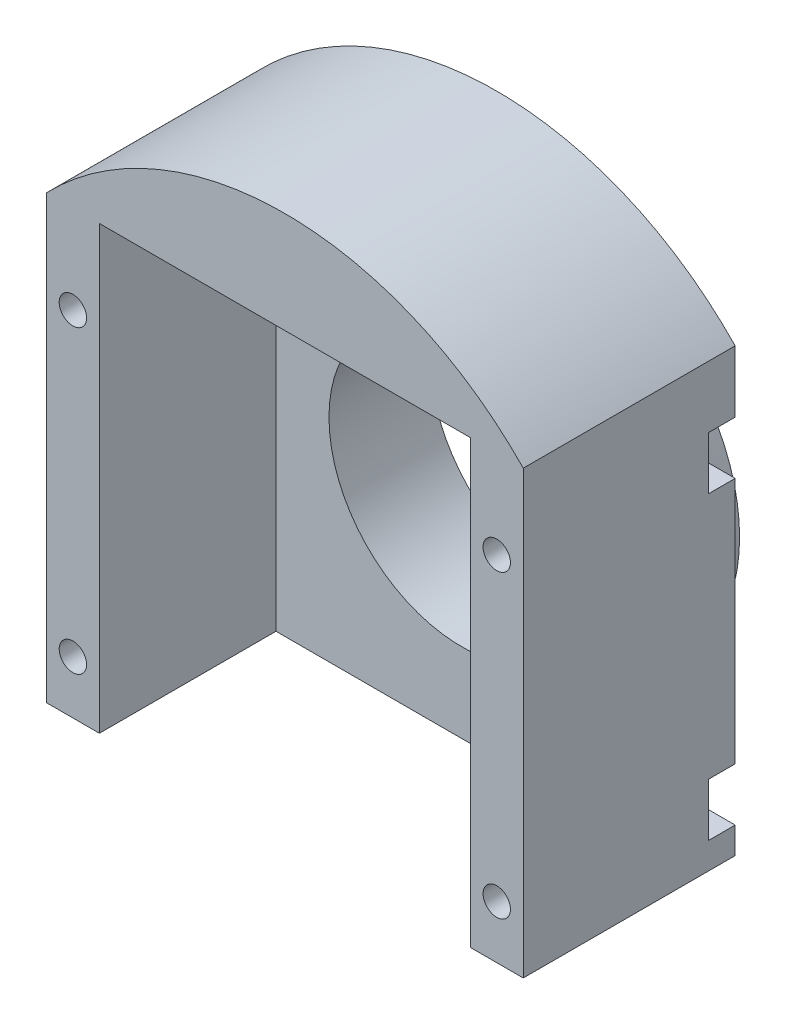
ISO-10303-21;
HEADER;
FILE_DESCRIPTION(('STEP AP214'),'2;1');
FILE_NAME('part.step','',(''),(''),'','','');
FILE_SCHEMA(('AUTOMOTIVE_DESIGN { 1 0 10303 214 1 1 1 1 }'));
ENDSEC;
DATA;
#1=APPLICATION_CONTEXT('core data for automotive mechanical design processes');
#2=APPLICATION_PROTOCOL_DEFINITION('international standard','automotive_design',2000,#1);
#3=PRODUCT_CONTEXT('',#1,'mechanical');
#4=PRODUCT('Part','Part','',(#3));
#5=PRODUCT_RELATED_PRODUCT_CATEGORY('part','',(#4));
#6=PRODUCT_DEFINITION_FORMATION('','',#4);
#7=PRODUCT_DEFINITION_CONTEXT('part definition',#1,'design');
#8=PRODUCT_DEFINITION('design','',#6,#7);
#9=PRODUCT_DEFINITION_SHAPE('','',#8);
#10=(LENGTH_UNIT() NAMED_UNIT(*) SI_UNIT(.MILLI.,.METRE.));
#11=(NAMED_UNIT(*) PLANE_ANGLE_UNIT() SI_UNIT($,.RADIAN.));
#12=(NAMED_UNIT(*) SI_UNIT($,.STERADIAN.) SOLID_ANGLE_UNIT());
#13=UNCERTAINTY_MEASURE_WITH_UNIT(LENGTH_MEASURE(1.E-05),#10,'distance_accuracy_value','');
#14=(GEOMETRIC_REPRESENTATION_CONTEXT(3) GLOBAL_UNCERTAINTY_ASSIGNED_CONTEXT((#13)) GLOBAL_UNIT_ASSIGNED_CONTEXT((#10,
#11,#12)) REPRESENTATION_CONTEXT('',''));
#15=CARTESIAN_POINT('',(0.,0.,0.));
#16=DIRECTION('',(0.,0.,1.));
#17=DIRECTION('',(1.,0.,0.));
#18=AXIS2_PLACEMENT_3D('',#15,#16,#17);
#19=CARTESIAN_POINT('',(0.,0.,0.));
#20=DIRECTION('',(0.,0.,1.));
#21=DIRECTION('',(1.,0.,0.));
#22=AXIS2_PLACEMENT_3D('',#19,#20,#21);
#23=PLANE('',#22);
#24=DIRECTION('',(0.,1.,0.));
#25=VECTOR('',#24,1.);
#26=CARTESIAN_POINT('',(27.,25.,0.));
#27=LINE('',#26,#25);
#28=CARTESIAN_POINT('',(27.,18.,0.));
#29=VERTEX_POINT('',#28);
#30=CARTESIAN_POINT('',(27.,25.,0.));
#31=VERTEX_POINT('',#30);
#32=EDGE_CURVE('E424',#29,#31,#27,.T.);
#33=ORIENTED_EDGE('',*,*,#32,.F.);
#34=DIRECTION('',(1.,0.,0.));
#35=VECTOR('',#34,1.);
#36=CARTESIAN_POINT('',(27.,18.,0.));
#37=LINE('',#36,#35);
#38=CARTESIAN_POINT('',(24.,18.,0.));
#39=VERTEX_POINT('',#38);
#40=EDGE_CURVE('E312',#39,#29,#37,.T.);
#41=ORIENTED_EDGE('',*,*,#40,.F.);
#42=CARTESIAN_POINT('',(24.,15.,0.));
#43=DIRECTION('',(0.,0.,-1.));
#44=DIRECTION('',(1.,0.,0.));
#45=AXIS2_PLACEMENT_3D('',#42,#43,#44);
#46=CIRCLE('',#45,3.);
#47=CARTESIAN_POINT('',(24.,12.,0.));
#48=VERTEX_POINT('',#47);
#49=EDGE_CURVE('E305',#48,#39,#46,.T.);
#50=ORIENTED_EDGE('',*,*,#49,.F.);
#51=DIRECTION('',(-1.,0.,0.));
#52=VECTOR('',#51,1.);
#53=CARTESIAN_POINT('',(24.,12.,0.));
#54=LINE('',#53,#52);
#55=CARTESIAN_POINT('',(27.,12.,0.));
#56=VERTEX_POINT('',#55);
#57=EDGE_CURVE('E308',#56,#48,#54,.T.);
#58=ORIENTED_EDGE('',*,*,#57,.F.);
#59=CARTESIAN_POINT('',(27.,-16.,0.));
#60=VERTEX_POINT('',#59);
#61=EDGE_CURVE('E902',#60,#56,#27,.T.);
#62=ORIENTED_EDGE('',*,*,#61,.F.);
#63=DIRECTION('',(1.,0.,0.));
#64=VECTOR('',#63,1.);
#65=CARTESIAN_POINT('',(27.,-16.,0.));
#66=LINE('',#65,#64);
#67=CARTESIAN_POINT('',(24.,-16.,0.));
#68=VERTEX_POINT('',#67);
#69=EDGE_CURVE('E354',#68,#60,#66,.T.);
#70=ORIENTED_EDGE('',*,*,#69,.F.);
#71=CARTESIAN_POINT('',(24.,-19.,0.));
#72=DIRECTION('',(0.,0.,-1.));
#73=DIRECTION('',(1.,0.,0.));
#74=AXIS2_PLACEMENT_3D('',#71,#72,#73);
#75=CIRCLE('',#74,3.);
#76=CARTESIAN_POINT('',(24.,-22.,0.));
#77=VERTEX_POINT('',#76);
#78=EDGE_CURVE('E366',#77,#68,#75,.T.);
#79=ORIENTED_EDGE('',*,*,#78,.F.);
#80=DIRECTION('',(-1.,0.,0.));
#81=VECTOR('',#80,1.);
#82=CARTESIAN_POINT('',(24.,-22.,0.));
#83=LINE('',#82,#81);
#84=CARTESIAN_POINT('',(27.,-22.,0.));
#85=VERTEX_POINT('',#84);
#86=EDGE_CURVE('E314',#85,#77,#83,.T.);
#87=ORIENTED_EDGE('',*,*,#86,.F.);
#88=CARTESIAN_POINT('',(27.,-25.,0.));
#89=VERTEX_POINT('',#88);
#90=EDGE_CURVE('E233',#89,#85,#27,.T.);
#91=ORIENTED_EDGE('',*,*,#90,.F.);
#92=DIRECTION('',(1.,0.,0.));
#93=VECTOR('',#92,1.);
#94=CARTESIAN_POINT('',(-27.,-25.,0.));
#95=LINE('',#94,#93);
#96=CARTESIAN_POINT('',(-27.,-25.,0.));
#97=VERTEX_POINT('',#96);
#98=EDGE_CURVE('E232',#97,#89,#95,.T.);
#99=ORIENTED_EDGE('',*,*,#98,.F.);
#100=DIRECTION('',(0.,-1.,0.));
#101=VECTOR('',#100,1.);
#102=CARTESIAN_POINT('',(-27.,25.,0.));
#103=LINE('',#102,#101);
#104=CARTESIAN_POINT('',(-27.,-22.,0.));
#105=VERTEX_POINT('',#104);
#106=EDGE_CURVE('E229',#105,#97,#103,.T.);
#107=ORIENTED_EDGE('',*,*,#106,.F.);
#108=DIRECTION('',(-1.,0.,0.));
#109=VECTOR('',#108,1.);
#110=CARTESIAN_POINT('',(-24.,-22.,0.));
#111=LINE('',#110,#109);
#112=CARTESIAN_POINT('',(-24.,-22.,0.));
#113=VERTEX_POINT('',#112);
#114=EDGE_CURVE('E333',#113,#105,#111,.T.);
#115=ORIENTED_EDGE('',*,*,#114,.F.);
#116=CARTESIAN_POINT('',(-24.,-19.,0.));
#117=DIRECTION('',(0.,0.,-1.));
#118=DIRECTION('',(-1.,0.,0.));
#119=AXIS2_PLACEMENT_3D('',#116,#117,#118);
#120=CIRCLE('',#119,3.);
#121=CARTESIAN_POINT('',(-24.,-16.,0.));
#122=VERTEX_POINT('',#121);
#123=EDGE_CURVE('E335',#122,#113,#120,.T.);
#124=ORIENTED_EDGE('',*,*,#123,.F.);
#125=DIRECTION('',(1.,0.,0.));
#126=VECTOR('',#125,1.);
#127=CARTESIAN_POINT('',(-27.,-16.,0.));
#128=LINE('',#127,#126);
#129=CARTESIAN_POINT('',(-27.,-16.,0.));
#130=VERTEX_POINT('',#129);
#131=EDGE_CURVE('E227',#130,#122,#128,.T.);
#132=ORIENTED_EDGE('',*,*,#131,.F.);
#133=CARTESIAN_POINT('',(-27.,12.,0.));
#134=VERTEX_POINT('',#133);
#135=EDGE_CURVE('E220',#134,#130,#103,.T.);
#136=ORIENTED_EDGE('',*,*,#135,.F.);
#137=DIRECTION('',(-1.,0.,0.));
#138=VECTOR('',#137,1.);
#139=CARTESIAN_POINT('',(-24.,12.,0.));
#140=LINE('',#139,#138);
#141=CARTESIAN_POINT('',(-24.,12.,0.));
#142=VERTEX_POINT('',#141);
#143=EDGE_CURVE('E201',#142,#134,#140,.T.);
#144=ORIENTED_EDGE('',*,*,#143,.F.);
#145=CARTESIAN_POINT('',(-24.,15.,0.));
#146=DIRECTION('',(0.,0.,-1.));
#147=DIRECTION('',(-1.,0.,0.));
#148=AXIS2_PLACEMENT_3D('',#145,#146,#147);
#149=CIRCLE('',#148,3.);
#150=CARTESIAN_POINT('',(-24.,18.,0.));
#151=VERTEX_POINT('',#150);
#152=EDGE_CURVE('E212',#151,#142,#149,.T.);
#153=ORIENTED_EDGE('',*,*,#152,.F.);
#154=DIRECTION('',(1.,0.,0.));
#155=VECTOR('',#154,1.);
#156=CARTESIAN_POINT('',(-27.,18.,0.));
#157=LINE('',#156,#155);
#158=CARTESIAN_POINT('',(-27.,18.,0.));
#159=VERTEX_POINT('',#158);
#160=EDGE_CURVE('E284',#159,#151,#157,.T.);
#161=ORIENTED_EDGE('',*,*,#160,.F.);
#162=CARTESIAN_POINT('',(-27.,25.,0.));
#163=VERTEX_POINT('',#162);
#164=EDGE_CURVE('E228',#163,#159,#103,.T.);
#165=ORIENTED_EDGE('',*,*,#164,.F.);
#166=CARTESIAN_POINT('',(0.,-0.999999999999997,0.));
#167=DIRECTION('',(0.,0.,1.));
#168=DIRECTION('',(1.,0.,0.));
#169=AXIS2_PLACEMENT_3D('',#166,#167,#168);
#170=CIRCLE('',#169,37.4833296279826);
#171=EDGE_CURVE('E407',#163,#31,#170,.F.);
#172=ORIENTED_EDGE('',*,*,#171,.T.);
#173=EDGE_LOOP('',(#33,#41,#50,#58,#62,#70,#79,#87,#91,#99,#107,#115,#124,#132,#136,#144,#153,
#161,#165,#172));
#174=FACE_BOUND('',#173,.T.);
#175=CARTESIAN_POINT('',(0.,-0.999999999999996,0.));
#176=DIRECTION('',(0.,0.,1.));
#177=DIRECTION('',(1.,0.,0.));
#178=AXIS2_PLACEMENT_3D('',#175,#176,#177);
#179=CIRCLE('',#178,21.);
#180=CARTESIAN_POINT('',(21.,-0.999999999999996,0.));
#181=VERTEX_POINT('',#180);
#182=EDGE_CURVE('E11',#181,#181,#179,.F.);
#183=ORIENTED_EDGE('',*,*,#182,.F.);
#184=EDGE_LOOP('',(#183));
#185=FACE_BOUND('',#184,.T.);
#186=ADVANCED_FACE('F39',(#174,#185),#23,.F.);
#187=CARTESIAN_POINT('',(-24.,15.,0.));
#188=DIRECTION('',(0.,0.,1.));
#189=DIRECTION('',(1.,0.,0.));
#190=AXIS2_PLACEMENT_3D('',#187,#188,#189);
#191=CYLINDRICAL_SURFACE('',#190,1.55);
#192=CARTESIAN_POINT('',(-24.,15.,24.));
#193=DIRECTION('',(0.,0.,1.));
#194=DIRECTION('',(1.,0.,0.));
#195=AXIS2_PLACEMENT_3D('',#192,#193,#194);
#196=CIRCLE('',#195,1.55);
#197=CARTESIAN_POINT('',(-22.45,15.,24.));
#198=VERTEX_POINT('',#197);
#199=EDGE_CURVE('E416',#198,#198,#196,.T.);
#200=ORIENTED_EDGE('',*,*,#199,.T.);
#201=EDGE_LOOP('',(#200));
#202=FACE_BOUND('',#201,.T.);
#203=CARTESIAN_POINT('',(-24.,15.,3.));
#204=DIRECTION('',(0.,0.,-1.));
#205=DIRECTION('',(-1.,0.,0.));
#206=AXIS2_PLACEMENT_3D('',#203,#204,#205);
#207=CIRCLE('',#206,1.55);
#208=CARTESIAN_POINT('',(-25.55,15.,3.));
#209=VERTEX_POINT('',#208);
#210=EDGE_CURVE('E261',#209,#209,#207,.F.);
#211=ORIENTED_EDGE('',*,*,#210,.F.);
#212=EDGE_LOOP('',(#211));
#213=FACE_BOUND('',#212,.T.);
#214=ADVANCED_FACE('F474',(#202,#213),#191,.F.);
#215=CARTESIAN_POINT('',(-24.,-19.,0.));
#216=DIRECTION('',(0.,0.,1.));
#217=DIRECTION('',(1.,0.,0.));
#218=AXIS2_PLACEMENT_3D('',#215,#216,#217);
#219=CYLINDRICAL_SURFACE('',#218,1.55);
#220=CARTESIAN_POINT('',(-24.,-19.,24.));
#221=DIRECTION('',(0.,0.,1.));
#222=DIRECTION('',(1.,0.,0.));
#223=AXIS2_PLACEMENT_3D('',#220,#221,#222);
#224=CIRCLE('',#223,1.55);
#225=CARTESIAN_POINT('',(-22.45,-19.,24.));
#226=VERTEX_POINT('',#225);
#227=EDGE_CURVE('E410',#226,#226,#224,.T.);
#228=ORIENTED_EDGE('',*,*,#227,.T.);
#229=EDGE_LOOP('',(#228));
#230=FACE_BOUND('',#229,.T.);
#231=CARTESIAN_POINT('',(-24.,-19.,3.));
#232=DIRECTION('',(0.,0.,-1.));
#233=DIRECTION('',(-1.,0.,0.));
#234=AXIS2_PLACEMENT_3D('',#231,#232,#233);
#235=CIRCLE('',#234,1.55);
#236=CARTESIAN_POINT('',(-25.55,-19.,3.));
#237=VERTEX_POINT('',#236);
#238=EDGE_CURVE('E251',#237,#237,#235,.F.);
#239=ORIENTED_EDGE('',*,*,#238,.F.);
#240=EDGE_LOOP('',(#239));
#241=FACE_BOUND('',#240,.T.);
#242=ADVANCED_FACE('F479',(#230,#241),#219,.F.);
#243=CARTESIAN_POINT('',(-27.,-25.,24.));
#244=DIRECTION('',(0.,1.,0.));
#245=DIRECTION('',(0.,0.,1.));
#246=AXIS2_PLACEMENT_3D('',#243,#244,#245);
#247=PLANE('',#246);
#248=DIRECTION('',(0.,0.,1.));
#249=VECTOR('',#248,1.);
#250=CARTESIAN_POINT('',(21.,-25.,4.));
#251=LINE('',#250,#249);
#252=CARTESIAN_POINT('',(21.,-25.,4.));
#253=VERTEX_POINT('',#252);
#254=CARTESIAN_POINT('',(21.,-25.,24.));
#255=VERTEX_POINT('',#254);
#256=EDGE_CURVE('E400',#253,#255,#251,.T.);
#257=ORIENTED_EDGE('',*,*,#256,.F.);
#258=DIRECTION('',(1.,0.,0.));
#259=VECTOR('',#258,1.);
#260=CARTESIAN_POINT('',(0.,-25.,4.));
#261=LINE('',#260,#259);
#262=CARTESIAN_POINT('',(-21.,-25.,4.));
#263=VERTEX_POINT('',#262);
#264=EDGE_CURVE('E383',#263,#253,#261,.T.);
#265=ORIENTED_EDGE('',*,*,#264,.F.);
#266=DIRECTION('',(0.,0.,1.));
#267=VECTOR('',#266,1.);
#268=CARTESIAN_POINT('',(-21.,-25.,4.));
#269=LINE('',#268,#267);
#270=CARTESIAN_POINT('',(-21.,-25.,24.));
#271=VERTEX_POINT('',#270);
#272=EDGE_CURVE('E402',#263,#271,#269,.T.);
#273=ORIENTED_EDGE('',*,*,#272,.T.);
#274=DIRECTION('',(1.,0.,0.));
#275=VECTOR('',#274,1.);
#276=CARTESIAN_POINT('',(-27.,-25.,24.));
#277=LINE('',#276,#275);
#278=CARTESIAN_POINT('',(-27.,-25.,24.));
#279=VERTEX_POINT('',#278);
#280=EDGE_CURVE('E243',#279,#271,#277,.T.);
#281=ORIENTED_EDGE('',*,*,#280,.F.);
#282=DIRECTION('',(0.,0.,-1.));
#283=VECTOR('',#282,1.);
#284=CARTESIAN_POINT('',(-27.,-25.,24.));
#285=LINE('',#284,#283);
#286=EDGE_CURVE('E242',#279,#97,#285,.T.);
#287=ORIENTED_EDGE('',*,*,#286,.T.);
#288=ORIENTED_EDGE('',*,*,#98,.T.);
#289=DIRECTION('',(0.,0.,-1.));
#290=VECTOR('',#289,1.);
#291=CARTESIAN_POINT('',(27.,-25.,24.));
#292=LINE('',#291,#290);
#293=CARTESIAN_POINT('',(27.,-25.,24.));
#294=VERTEX_POINT('',#293);
#295=EDGE_CURVE('E239',#294,#89,#292,.T.);
#296=ORIENTED_EDGE('',*,*,#295,.F.);
#297=EDGE_CURVE('E427',#255,#294,#277,.T.);
#298=ORIENTED_EDGE('',*,*,#297,.F.);
#299=EDGE_LOOP('',(#257,#265,#273,#281,#287,#288,#296,#298));
#300=FACE_BOUND('',#299,.T.);
#301=ADVANCED_FACE('F438',(#300),#247,.F.);
#302=CARTESIAN_POINT('',(0.,0.,24.));
#303=DIRECTION('',(0.,0.,1.));
#304=DIRECTION('',(1.,0.,0.));
#305=AXIS2_PLACEMENT_3D('',#302,#303,#304);
#306=PLANE('',#305);
#307=ORIENTED_EDGE('',*,*,#227,.F.);
#308=EDGE_LOOP('',(#307));
#309=FACE_BOUND('',#308,.T.);
#310=CARTESIAN_POINT('',(24.,-19.,24.));
#311=DIRECTION('',(0.,0.,1.));
#312=DIRECTION('',(1.,0.,0.));
#313=AXIS2_PLACEMENT_3D('',#310,#311,#312);
#314=CIRCLE('',#313,1.55000000000001);
#315=CARTESIAN_POINT('',(25.55,-19.,24.));
#316=VERTEX_POINT('',#315);
#317=EDGE_CURVE('E417',#316,#316,#314,.T.);
#318=ORIENTED_EDGE('',*,*,#317,.F.);
#319=EDGE_LOOP('',(#318));
#320=FACE_BOUND('',#319,.T.);
#321=CARTESIAN_POINT('',(24.,15.,24.));
#322=DIRECTION('',(0.,0.,1.));
#323=DIRECTION('',(1.,0.,0.));
#324=AXIS2_PLACEMENT_3D('',#321,#322,#323);
#325=CIRCLE('',#324,1.55000000000001);
#326=CARTESIAN_POINT('',(25.55,15.,24.));
#327=VERTEX_POINT('',#326);
#328=EDGE_CURVE('E413',#327,#327,#325,.T.);
#329=ORIENTED_EDGE('',*,*,#328,.F.);
#330=EDGE_LOOP('',(#329));
#331=FACE_BOUND('',#330,.T.);
#332=ORIENTED_EDGE('',*,*,#199,.F.);
#333=EDGE_LOOP('',(#332));
#334=FACE_BOUND('',#333,.T.);
#335=DIRECTION('',(1.,0.,0.));
#336=VECTOR('',#335,1.);
#337=CARTESIAN_POINT('',(0.,25.,24.));
#338=LINE('',#337,#336);
#339=CARTESIAN_POINT('',(-21.,25.,24.));
#340=VERTEX_POINT('',#339);
#341=CARTESIAN_POINT('',(21.,25.,24.));
#342=VERTEX_POINT('',#341);
#343=EDGE_CURVE('E263',#340,#342,#338,.T.);
#344=ORIENTED_EDGE('',*,*,#343,.T.);
#345=DIRECTION('',(0.,-1.,0.));
#346=VECTOR('',#345,1.);
#347=CARTESIAN_POINT('',(21.,0.,24.));
#348=LINE('',#347,#346);
#349=EDGE_CURVE('E381',#342,#255,#348,.T.);
#350=ORIENTED_EDGE('',*,*,#349,.T.);
#351=ORIENTED_EDGE('',*,*,#297,.T.);
#352=DIRECTION('',(0.,1.,0.));
#353=VECTOR('',#352,1.);
#354=CARTESIAN_POINT('',(27.,25.,24.));
#355=LINE('',#354,#353);
#356=CARTESIAN_POINT('',(27.,25.,24.));
#357=VERTEX_POINT('',#356);
#358=EDGE_CURVE('E238',#294,#357,#355,.T.);
#359=ORIENTED_EDGE('',*,*,#358,.T.);
#360=CARTESIAN_POINT('',(0.,-0.999999999999997,24.));
#361=DIRECTION('',(0.,0.,1.));
#362=DIRECTION('',(-1.,0.,0.));
#363=AXIS2_PLACEMENT_3D('',#360,#361,#362);
#364=CIRCLE('',#363,37.4833296279826);
#365=CARTESIAN_POINT('',(-27.,25.,24.));
#366=VERTEX_POINT('',#365);
#367=EDGE_CURVE('E399',#357,#366,#364,.T.);
#368=ORIENTED_EDGE('',*,*,#367,.T.);
#369=DIRECTION('',(0.,-1.,0.));
#370=VECTOR('',#369,1.);
#371=CARTESIAN_POINT('',(-27.,25.,24.));
#372=LINE('',#371,#370);
#373=EDGE_CURVE('E426',#366,#279,#372,.T.);
#374=ORIENTED_EDGE('',*,*,#373,.T.);
#375=ORIENTED_EDGE('',*,*,#280,.T.);
#376=DIRECTION('',(0.,1.,0.));
#377=VECTOR('',#376,1.);
#378=CARTESIAN_POINT('',(-21.,0.,24.));
#379=LINE('',#378,#377);
#380=EDGE_CURVE('E391',#271,#340,#379,.T.);
#381=ORIENTED_EDGE('',*,*,#380,.T.);
#382=EDGE_LOOP('',(#344,#350,#351,#359,#368,#374,#375,#381));
#383=FACE_BOUND('',#382,.T.);
#384=ADVANCED_FACE('F433',(#309,#320,#331,#334,#383),#306,.T.);
#385=CARTESIAN_POINT('',(27.,25.,24.));
#386=DIRECTION('',(-1.,0.,0.));
#387=DIRECTION('',(0.,0.,1.));
#388=AXIS2_PLACEMENT_3D('',#385,#386,#387);
#389=PLANE('',#388);
#390=DIRECTION('',(0.,-1.,0.));
#391=VECTOR('',#390,1.);
#392=CARTESIAN_POINT('',(27.,18.,3.));
#393=LINE('',#392,#391);
#394=CARTESIAN_POINT('',(27.,18.,3.));
#395=VERTEX_POINT('',#394);
#396=CARTESIAN_POINT('',(27.,12.,3.));
#397=VERTEX_POINT('',#396);
#398=EDGE_CURVE('E320',#395,#397,#393,.T.);
#399=ORIENTED_EDGE('',*,*,#398,.F.);
#400=DIRECTION('',(0.,0.,-1.));
#401=VECTOR('',#400,1.);
#402=CARTESIAN_POINT('',(27.,18.,3.));
#403=LINE('',#402,#401);
#404=EDGE_CURVE('E295',#395,#29,#403,.T.);
#405=ORIENTED_EDGE('',*,*,#404,.T.);
#406=ORIENTED_EDGE('',*,*,#32,.T.);
#407=DIRECTION('',(0.,0.,-1.));
#408=VECTOR('',#407,1.);
#409=CARTESIAN_POINT('',(27.,25.,24.));
#410=LINE('',#409,#408);
#411=EDGE_CURVE('E47',#357,#31,#410,.T.);
#412=ORIENTED_EDGE('',*,*,#411,.F.);
#413=ORIENTED_EDGE('',*,*,#358,.F.);
#414=ORIENTED_EDGE('',*,*,#295,.T.);
#415=ORIENTED_EDGE('',*,*,#90,.T.);
#416=DIRECTION('',(0.,0.,-1.));
#417=VECTOR('',#416,1.);
#418=CARTESIAN_POINT('',(27.,-22.,3.));
#419=LINE('',#418,#417);
#420=CARTESIAN_POINT('',(27.,-22.,3.));
#421=VERTEX_POINT('',#420);
#422=EDGE_CURVE('E363',#421,#85,#419,.T.);
#423=ORIENTED_EDGE('',*,*,#422,.F.);
#424=DIRECTION('',(0.,-1.,0.));
#425=VECTOR('',#424,1.);
#426=CARTESIAN_POINT('',(27.,-16.,3.));
#427=LINE('',#426,#425);
#428=CARTESIAN_POINT('',(27.,-16.,3.));
#429=VERTEX_POINT('',#428);
#430=EDGE_CURVE('E350',#429,#421,#427,.T.);
#431=ORIENTED_EDGE('',*,*,#430,.F.);
#432=DIRECTION('',(0.,0.,-1.));
#433=VECTOR('',#432,1.);
#434=CARTESIAN_POINT('',(27.,-16.,3.));
#435=LINE('',#434,#433);
#436=EDGE_CURVE('E255',#429,#60,#435,.T.);
#437=ORIENTED_EDGE('',*,*,#436,.T.);
#438=ORIENTED_EDGE('',*,*,#61,.T.);
#439=DIRECTION('',(0.,0.,-1.));
#440=VECTOR('',#439,1.);
#441=CARTESIAN_POINT('',(27.,12.,3.));
#442=LINE('',#441,#440);
#443=EDGE_CURVE('E299',#397,#56,#442,.T.);
#444=ORIENTED_EDGE('',*,*,#443,.F.);
#445=EDGE_LOOP('',(#399,#405,#406,#412,#413,#414,#415,#423,#431,#437,#438,#444));
#446=FACE_BOUND('',#445,.T.);
#447=ADVANCED_FACE('F41',(#446),#389,.F.);
#448=CARTESIAN_POINT('',(-27.,25.,24.));
#449=DIRECTION('',(1.,0.,0.));
#450=DIRECTION('',(0.,0.,-1.));
#451=AXIS2_PLACEMENT_3D('',#448,#449,#450);
#452=PLANE('',#451);
#453=DIRECTION('',(0.,1.,0.));
#454=VECTOR('',#453,1.);
#455=CARTESIAN_POINT('',(-27.,-16.,3.));
#456=LINE('',#455,#454);
#457=CARTESIAN_POINT('',(-27.,-22.,3.));
#458=VERTEX_POINT('',#457);
#459=CARTESIAN_POINT('',(-27.,-16.,3.));
#460=VERTEX_POINT('',#459);
#461=EDGE_CURVE('E336',#458,#460,#456,.T.);
#462=ORIENTED_EDGE('',*,*,#461,.F.);
#463=DIRECTION('',(0.,0.,-1.));
#464=VECTOR('',#463,1.);
#465=CARTESIAN_POINT('',(-27.,-22.,3.));
#466=LINE('',#465,#464);
#467=EDGE_CURVE('E286',#458,#105,#466,.T.);
#468=ORIENTED_EDGE('',*,*,#467,.T.);
#469=ORIENTED_EDGE('',*,*,#106,.T.);
#470=ORIENTED_EDGE('',*,*,#286,.F.);
#471=ORIENTED_EDGE('',*,*,#373,.F.);
#472=DIRECTION('',(0.,0.,-1.));
#473=VECTOR('',#472,1.);
#474=CARTESIAN_POINT('',(-27.,25.,24.));
#475=LINE('',#474,#473);
#476=EDGE_CURVE('E246',#366,#163,#475,.T.);
#477=ORIENTED_EDGE('',*,*,#476,.T.);
#478=ORIENTED_EDGE('',*,*,#164,.T.);
#479=DIRECTION('',(0.,0.,-1.));
#480=VECTOR('',#479,1.);
#481=CARTESIAN_POINT('',(-27.,18.,3.));
#482=LINE('',#481,#480);
#483=CARTESIAN_POINT('',(-27.,18.,3.));
#484=VERTEX_POINT('',#483);
#485=EDGE_CURVE('E62',#484,#159,#482,.T.);
#486=ORIENTED_EDGE('',*,*,#485,.F.);
#487=DIRECTION('',(0.,1.,0.));
#488=VECTOR('',#487,1.);
#489=CARTESIAN_POINT('',(-27.,18.,3.));
#490=LINE('',#489,#488);
#491=CARTESIAN_POINT('',(-27.,12.,3.));
#492=VERTEX_POINT('',#491);
#493=EDGE_CURVE('E213',#492,#484,#490,.T.);
#494=ORIENTED_EDGE('',*,*,#493,.F.);
#495=DIRECTION('',(0.,0.,-1.));
#496=VECTOR('',#495,1.);
#497=CARTESIAN_POINT('',(-27.,12.,3.));
#498=LINE('',#497,#496);
#499=EDGE_CURVE('E205',#492,#134,#498,.T.);
#500=ORIENTED_EDGE('',*,*,#499,.T.);
#501=ORIENTED_EDGE('',*,*,#135,.T.);
#502=DIRECTION('',(0.,0.,-1.));
#503=VECTOR('',#502,1.);
#504=CARTESIAN_POINT('',(-27.,-16.,3.));
#505=LINE('',#504,#503);
#506=EDGE_CURVE('E54',#460,#130,#505,.T.);
#507=ORIENTED_EDGE('',*,*,#506,.F.);
#508=EDGE_LOOP('',(#462,#468,#469,#470,#471,#477,#478,#486,#494,#500,#501,#507));
#509=FACE_BOUND('',#508,.T.);
#510=ADVANCED_FACE('F219',(#509),#452,.F.);
#511=CARTESIAN_POINT('',(24.,15.,0.));
#512=DIRECTION('',(0.,0.,1.));
#513=DIRECTION('',(1.,0.,0.));
#514=AXIS2_PLACEMENT_3D('',#511,#512,#513);
#515=CYLINDRICAL_SURFACE('',#514,1.55000000000001);
#516=CARTESIAN_POINT('',(24.,15.,3.));
#517=DIRECTION('',(0.,0.,1.));
#518=DIRECTION('',(1.,0.,0.));
#519=AXIS2_PLACEMENT_3D('',#516,#517,#518);
#520=CIRCLE('',#519,1.55000000000001);
#521=CARTESIAN_POINT('',(25.55,15.,3.));
#522=VERTEX_POINT('',#521);
#523=EDGE_CURVE('E258',#522,#522,#520,.F.);
#524=ORIENTED_EDGE('',*,*,#523,.T.);
#525=EDGE_LOOP('',(#524));
#526=FACE_BOUND('',#525,.T.);
#527=ORIENTED_EDGE('',*,*,#328,.T.);
#528=EDGE_LOOP('',(#527));
#529=FACE_BOUND('',#528,.T.);
#530=ADVANCED_FACE('F486',(#526,#529),#515,.F.);
#531=CARTESIAN_POINT('',(24.,-19.,0.));
#532=DIRECTION('',(0.,0.,1.));
#533=DIRECTION('',(1.,0.,0.));
#534=AXIS2_PLACEMENT_3D('',#531,#532,#533);
#535=CYLINDRICAL_SURFACE('',#534,1.55000000000001);
#536=CARTESIAN_POINT('',(24.,-19.,3.));
#537=DIRECTION('',(0.,0.,1.));
#538=DIRECTION('',(1.,0.,0.));
#539=AXIS2_PLACEMENT_3D('',#536,#537,#538);
#540=CIRCLE('',#539,1.55000000000001);
#541=CARTESIAN_POINT('',(25.55,-19.,3.));
#542=VERTEX_POINT('',#541);
#543=EDGE_CURVE('E254',#542,#542,#540,.F.);
#544=ORIENTED_EDGE('',*,*,#543,.T.);
#545=EDGE_LOOP('',(#544));
#546=FACE_BOUND('',#545,.T.);
#547=ORIENTED_EDGE('',*,*,#317,.T.);
#548=EDGE_LOOP('',(#547));
#549=FACE_BOUND('',#548,.T.);
#550=ADVANCED_FACE('F491',(#546,#549),#535,.F.);
#551=CARTESIAN_POINT('',(0.,-0.999999999999997,-55.2074891599401));
#552=DIRECTION('',(0.,0.,1.));
#553=DIRECTION('',(1.,0.,0.));
#554=AXIS2_PLACEMENT_3D('',#551,#552,#553);
#555=CYLINDRICAL_SURFACE('',#554,37.4833296279826);
#556=ORIENTED_EDGE('',*,*,#171,.F.);
#557=ORIENTED_EDGE('',*,*,#476,.F.);
#558=ORIENTED_EDGE('',*,*,#367,.F.);
#559=ORIENTED_EDGE('',*,*,#411,.T.);
#560=EDGE_LOOP('',(#556,#557,#558,#559));
#561=FACE_BOUND('',#560,.T.);
#562=ADVANCED_FACE('F448',(#561),#555,.T.);
#563=CARTESIAN_POINT('',(0.,25.,4.));
#564=DIRECTION('',(0.,-1.,0.));
#565=DIRECTION('',(0.,0.,-1.));
#566=AXIS2_PLACEMENT_3D('',#563,#564,#565);
#567=PLANE('',#566);
#568=ORIENTED_EDGE('',*,*,#343,.F.);
#569=DIRECTION('',(0.,0.,1.));
#570=VECTOR('',#569,1.);
#571=CARTESIAN_POINT('',(-21.,25.,4.));
#572=LINE('',#571,#570);
#573=CARTESIAN_POINT('',(-21.,25.,4.));
#574=VERTEX_POINT('',#573);
#575=EDGE_CURVE('E388',#574,#340,#572,.T.);
#576=ORIENTED_EDGE('',*,*,#575,.F.);
#577=DIRECTION('',(1.,0.,0.));
#578=VECTOR('',#577,1.);
#579=CARTESIAN_POINT('',(0.,25.,4.));
#580=LINE('',#579,#578);
#581=CARTESIAN_POINT('',(21.,25.,4.));
#582=VERTEX_POINT('',#581);
#583=EDGE_CURVE('E377',#574,#582,#580,.T.);
#584=ORIENTED_EDGE('',*,*,#583,.T.);
#585=DIRECTION('',(0.,0.,1.));
#586=VECTOR('',#585,1.);
#587=CARTESIAN_POINT('',(21.,25.,4.));
#588=LINE('',#587,#586);
#589=EDGE_CURVE('E396',#582,#342,#588,.T.);
#590=ORIENTED_EDGE('',*,*,#589,.T.);
#591=EDGE_LOOP('',(#568,#576,#584,#590));
#592=FACE_BOUND('',#591,.T.);
#593=ADVANCED_FACE('F461',(#592),#567,.T.);
#594=CARTESIAN_POINT('',(21.,0.,4.));
#595=DIRECTION('',(-1.,0.,0.));
#596=DIRECTION('',(0.,-1.,0.));
#597=AXIS2_PLACEMENT_3D('',#594,#595,#596);
#598=PLANE('',#597);
#599=ORIENTED_EDGE('',*,*,#349,.F.);
#600=ORIENTED_EDGE('',*,*,#589,.F.);
#601=DIRECTION('',(0.,-1.,0.));
#602=VECTOR('',#601,1.);
#603=CARTESIAN_POINT('',(21.,0.,4.));
#604=LINE('',#603,#602);
#605=EDGE_CURVE('E386',#582,#253,#604,.T.);
#606=ORIENTED_EDGE('',*,*,#605,.T.);
#607=ORIENTED_EDGE('',*,*,#256,.T.);
#608=EDGE_LOOP('',(#599,#600,#606,#607));
#609=FACE_BOUND('',#608,.T.);
#610=ADVANCED_FACE('F463',(#609),#598,.T.);
#611=CARTESIAN_POINT('',(-21.,0.,4.));
#612=DIRECTION('',(1.,0.,0.));
#613=DIRECTION('',(0.,0.,-1.));
#614=AXIS2_PLACEMENT_3D('',#611,#612,#613);
#615=PLANE('',#614);
#616=ORIENTED_EDGE('',*,*,#380,.F.);
#617=ORIENTED_EDGE('',*,*,#272,.F.);
#618=DIRECTION('',(0.,1.,0.));
#619=VECTOR('',#618,1.);
#620=CARTESIAN_POINT('',(-21.,0.,4.));
#621=LINE('',#620,#619);
#622=EDGE_CURVE('E380',#263,#574,#621,.T.);
#623=ORIENTED_EDGE('',*,*,#622,.T.);
#624=ORIENTED_EDGE('',*,*,#575,.T.);
#625=EDGE_LOOP('',(#616,#617,#623,#624));
#626=FACE_BOUND('',#625,.T.);
#627=ADVANCED_FACE('F454',(#626),#615,.T.);
#628=CARTESIAN_POINT('',(0.,0.,4.));
#629=DIRECTION('',(0.,0.,1.));
#630=DIRECTION('',(1.,0.,0.));
#631=AXIS2_PLACEMENT_3D('',#628,#629,#630);
#632=PLANE('',#631);
#633=CARTESIAN_POINT('',(0.,-0.999999999999996,4.));
#634=DIRECTION('',(0.,0.,1.));
#635=DIRECTION('',(1.,0.,0.));
#636=AXIS2_PLACEMENT_3D('',#633,#634,#635);
#637=CIRCLE('',#636,15.);
#638=CARTESIAN_POINT('',(15.,-0.999999999999996,4.));
#639=VERTEX_POINT('',#638);
#640=EDGE_CURVE('E222',#639,#639,#637,.T.);
#641=ORIENTED_EDGE('',*,*,#640,.F.);
#642=EDGE_LOOP('',(#641));
#643=FACE_BOUND('',#642,.T.);
#644=ORIENTED_EDGE('',*,*,#583,.F.);
#645=ORIENTED_EDGE('',*,*,#622,.F.);
#646=ORIENTED_EDGE('',*,*,#264,.T.);
#647=ORIENTED_EDGE('',*,*,#605,.F.);
#648=EDGE_LOOP('',(#644,#645,#646,#647));
#649=FACE_BOUND('',#648,.T.);
#650=ADVANCED_FACE('F458',(#643,#649),#632,.T.);
#651=CARTESIAN_POINT('',(-24.,-19.,3.));
#652=DIRECTION('',(0.,0.,-1.));
#653=DIRECTION('',(-1.,0.,0.));
#654=AXIS2_PLACEMENT_3D('',#651,#652,#653);
#655=PLANE('',#654);
#656=ORIENTED_EDGE('',*,*,#461,.T.);
#657=DIRECTION('',(1.,0.,0.));
#658=VECTOR('',#657,1.);
#659=CARTESIAN_POINT('',(-27.,-16.,3.));
#660=LINE('',#659,#658);
#661=CARTESIAN_POINT('',(-24.,-16.,3.));
#662=VERTEX_POINT('',#661);
#663=EDGE_CURVE('E345',#460,#662,#660,.T.);
#664=ORIENTED_EDGE('',*,*,#663,.T.);
#665=CARTESIAN_POINT('',(-24.,-19.,3.));
#666=DIRECTION('',(0.,0.,-1.));
#667=DIRECTION('',(-1.,0.,0.));
#668=AXIS2_PLACEMENT_3D('',#665,#666,#667);
#669=CIRCLE('',#668,3.);
#670=CARTESIAN_POINT('',(-24.,-22.,3.));
#671=VERTEX_POINT('',#670);
#672=EDGE_CURVE('E342',#662,#671,#669,.T.);
#673=ORIENTED_EDGE('',*,*,#672,.T.);
#674=DIRECTION('',(-1.,0.,0.));
#675=VECTOR('',#674,1.);
#676=CARTESIAN_POINT('',(-24.,-22.,3.));
#677=LINE('',#676,#675);
#678=EDGE_CURVE('E326',#671,#458,#677,.T.);
#679=ORIENTED_EDGE('',*,*,#678,.T.);
#680=EDGE_LOOP('',(#656,#664,#673,#679));
#681=FACE_BOUND('',#680,.T.);
#682=ORIENTED_EDGE('',*,*,#238,.T.);
#683=EDGE_LOOP('',(#682));
#684=FACE_BOUND('',#683,.T.);
#685=ADVANCED_FACE('F549',(#681,#684),#655,.T.);
#686=CARTESIAN_POINT('',(-24.,-22.,3.));
#687=DIRECTION('',(0.,-1.,0.));
#688=DIRECTION('',(0.,0.,-1.));
#689=AXIS2_PLACEMENT_3D('',#686,#687,#688);
#690=PLANE('',#689);
#691=ORIENTED_EDGE('',*,*,#114,.T.);
#692=ORIENTED_EDGE('',*,*,#467,.F.);
#693=ORIENTED_EDGE('',*,*,#678,.F.);
#694=DIRECTION('',(0.,0.,-1.));
#695=VECTOR('',#694,1.);
#696=CARTESIAN_POINT('',(-24.,-22.,3.));
#697=LINE('',#696,#695);
#698=EDGE_CURVE('E329',#671,#113,#697,.T.);
#699=ORIENTED_EDGE('',*,*,#698,.T.);
#700=EDGE_LOOP('',(#691,#692,#693,#699));
#701=FACE_BOUND('',#700,.T.);
#702=ADVANCED_FACE('F545',(#701),#690,.F.);
#703=CARTESIAN_POINT('',(-24.,-19.,3.));
#704=DIRECTION('',(0.,0.,-1.));
#705=DIRECTION('',(-1.,0.,0.));
#706=AXIS2_PLACEMENT_3D('',#703,#704,#705);
#707=CYLINDRICAL_SURFACE('',#706,3.);
#708=ORIENTED_EDGE('',*,*,#123,.T.);
#709=ORIENTED_EDGE('',*,*,#698,.F.);
#710=ORIENTED_EDGE('',*,*,#672,.F.);
#711=DIRECTION('',(0.,0.,-1.));
#712=VECTOR('',#711,1.);
#713=CARTESIAN_POINT('',(-24.,-16.,3.));
#714=LINE('',#713,#712);
#715=EDGE_CURVE('E327',#662,#122,#714,.T.);
#716=ORIENTED_EDGE('',*,*,#715,.T.);
#717=EDGE_LOOP('',(#708,#709,#710,#716));
#718=FACE_BOUND('',#717,.T.);
#719=ADVANCED_FACE('F542',(#718),#707,.F.);
#720=CARTESIAN_POINT('',(-27.,-16.,3.));
#721=DIRECTION('',(0.,1.,0.));
#722=DIRECTION('',(0.,0.,1.));
#723=AXIS2_PLACEMENT_3D('',#720,#721,#722);
#724=PLANE('',#723);
#725=ORIENTED_EDGE('',*,*,#131,.T.);
#726=ORIENTED_EDGE('',*,*,#715,.F.);
#727=ORIENTED_EDGE('',*,*,#663,.F.);
#728=ORIENTED_EDGE('',*,*,#506,.T.);
#729=EDGE_LOOP('',(#725,#726,#727,#728));
#730=FACE_BOUND('',#729,.T.);
#731=ADVANCED_FACE('F538',(#730),#724,.F.);
#732=CARTESIAN_POINT('',(24.,-19.,3.));
#733=DIRECTION('',(0.,0.,1.));
#734=DIRECTION('',(1.,0.,0.));
#735=AXIS2_PLACEMENT_3D('',#732,#733,#734);
#736=PLANE('',#735);
#737=ORIENTED_EDGE('',*,*,#430,.T.);
#738=DIRECTION('',(-1.,0.,0.));
#739=VECTOR('',#738,1.);
#740=CARTESIAN_POINT('',(24.,-22.,3.));
#741=LINE('',#740,#739);
#742=CARTESIAN_POINT('',(24.,-22.,3.));
#743=VERTEX_POINT('',#742);
#744=EDGE_CURVE('E353',#421,#743,#741,.T.);
#745=ORIENTED_EDGE('',*,*,#744,.T.);
#746=CARTESIAN_POINT('',(24.,-19.,3.));
#747=DIRECTION('',(0.,0.,-1.));
#748=DIRECTION('',(1.,0.,0.));
#749=AXIS2_PLACEMENT_3D('',#746,#747,#748);
#750=CIRCLE('',#749,3.);
#751=CARTESIAN_POINT('',(24.,-16.,3.));
#752=VERTEX_POINT('',#751);
#753=EDGE_CURVE('E357',#743,#752,#750,.T.);
#754=ORIENTED_EDGE('',*,*,#753,.T.);
#755=DIRECTION('',(1.,0.,0.));
#756=VECTOR('',#755,1.);
#757=CARTESIAN_POINT('',(27.,-16.,3.));
#758=LINE('',#757,#756);
#759=EDGE_CURVE('E360',#752,#429,#758,.T.);
#760=ORIENTED_EDGE('',*,*,#759,.T.);
#761=EDGE_LOOP('',(#737,#745,#754,#760));
#762=FACE_BOUND('',#761,.T.);
#763=ORIENTED_EDGE('',*,*,#543,.F.);
#764=EDGE_LOOP('',(#763));
#765=FACE_BOUND('',#764,.T.);
#766=ADVANCED_FACE('F541',(#762,#765),#736,.F.);
#767=CARTESIAN_POINT('',(27.,-16.,3.));
#768=DIRECTION('',(0.,1.,0.));
#769=DIRECTION('',(0.,0.,1.));
#770=AXIS2_PLACEMENT_3D('',#767,#768,#769);
#771=PLANE('',#770);
#772=ORIENTED_EDGE('',*,*,#69,.T.);
#773=ORIENTED_EDGE('',*,*,#436,.F.);
#774=ORIENTED_EDGE('',*,*,#759,.F.);
#775=DIRECTION('',(0.,0.,-1.));
#776=VECTOR('',#775,1.);
#777=CARTESIAN_POINT('',(24.,-16.,3.));
#778=LINE('',#777,#776);
#779=EDGE_CURVE('E372',#752,#68,#778,.T.);
#780=ORIENTED_EDGE('',*,*,#779,.T.);
#781=EDGE_LOOP('',(#772,#773,#774,#780));
#782=FACE_BOUND('',#781,.T.);
#783=ADVANCED_FACE('F556',(#782),#771,.F.);
#784=CARTESIAN_POINT('',(24.,-19.,3.));
#785=DIRECTION('',(0.,0.,-1.));
#786=DIRECTION('',(-1.,0.,0.));
#787=AXIS2_PLACEMENT_3D('',#784,#785,#786);
#788=CYLINDRICAL_SURFACE('',#787,3.);
#789=ORIENTED_EDGE('',*,*,#78,.T.);
#790=ORIENTED_EDGE('',*,*,#779,.F.);
#791=ORIENTED_EDGE('',*,*,#753,.F.);
#792=DIRECTION('',(0.,0.,-1.));
#793=VECTOR('',#792,1.);
#794=CARTESIAN_POINT('',(24.,-22.,3.));
#795=LINE('',#794,#793);
#796=EDGE_CURVE('E374',#743,#77,#795,.T.);
#797=ORIENTED_EDGE('',*,*,#796,.T.);
#798=EDGE_LOOP('',(#789,#790,#791,#797));
#799=FACE_BOUND('',#798,.T.);
#800=ADVANCED_FACE('F560',(#799),#788,.F.);
#801=CARTESIAN_POINT('',(24.,-22.,3.));
#802=DIRECTION('',(0.,-1.,0.));
#803=DIRECTION('',(0.,0.,-1.));
#804=AXIS2_PLACEMENT_3D('',#801,#802,#803);
#805=PLANE('',#804);
#806=ORIENTED_EDGE('',*,*,#86,.T.);
#807=ORIENTED_EDGE('',*,*,#796,.F.);
#808=ORIENTED_EDGE('',*,*,#744,.F.);
#809=ORIENTED_EDGE('',*,*,#422,.T.);
#810=EDGE_LOOP('',(#806,#807,#808,#809));
#811=FACE_BOUND('',#810,.T.);
#812=ADVANCED_FACE('F536',(#811),#805,.F.);
#813=CARTESIAN_POINT('',(24.,15.,3.));
#814=DIRECTION('',(0.,0.,1.));
#815=DIRECTION('',(1.,0.,0.));
#816=AXIS2_PLACEMENT_3D('',#813,#814,#815);
#817=PLANE('',#816);
#818=DIRECTION('',(1.,0.,0.));
#819=VECTOR('',#818,1.);
#820=CARTESIAN_POINT('',(27.,18.,3.));
#821=LINE('',#820,#819);
#822=CARTESIAN_POINT('',(24.,18.,3.));
#823=VERTEX_POINT('',#822);
#824=EDGE_CURVE('E309',#823,#395,#821,.T.);
#825=ORIENTED_EDGE('',*,*,#824,.T.);
#826=ORIENTED_EDGE('',*,*,#398,.T.);
#827=DIRECTION('',(-1.,0.,0.));
#828=VECTOR('',#827,1.);
#829=CARTESIAN_POINT('',(24.,12.,3.));
#830=LINE('',#829,#828);
#831=CARTESIAN_POINT('',(24.,12.,3.));
#832=VERTEX_POINT('',#831);
#833=EDGE_CURVE('E317',#397,#832,#830,.T.);
#834=ORIENTED_EDGE('',*,*,#833,.T.);
#835=CARTESIAN_POINT('',(24.,15.,3.));
#836=DIRECTION('',(0.,0.,-1.));
#837=DIRECTION('',(1.,0.,0.));
#838=AXIS2_PLACEMENT_3D('',#835,#836,#837);
#839=CIRCLE('',#838,3.);
#840=EDGE_CURVE('E298',#832,#823,#839,.T.);
#841=ORIENTED_EDGE('',*,*,#840,.T.);
#842=EDGE_LOOP('',(#825,#826,#834,#841));
#843=FACE_BOUND('',#842,.T.);
#844=ORIENTED_EDGE('',*,*,#523,.F.);
#845=EDGE_LOOP('',(#844));
#846=FACE_BOUND('',#845,.T.);
#847=ADVANCED_FACE('F528',(#843,#846),#817,.F.);
#848=CARTESIAN_POINT('',(27.,18.,3.));
#849=DIRECTION('',(0.,1.,0.));
#850=DIRECTION('',(0.,0.,1.));
#851=AXIS2_PLACEMENT_3D('',#848,#849,#850);
#852=PLANE('',#851);
#853=ORIENTED_EDGE('',*,*,#40,.T.);
#854=ORIENTED_EDGE('',*,*,#404,.F.);
#855=ORIENTED_EDGE('',*,*,#824,.F.);
#856=DIRECTION('',(0.,0.,-1.));
#857=VECTOR('',#856,1.);
#858=CARTESIAN_POINT('',(24.,18.,3.));
#859=LINE('',#858,#857);
#860=EDGE_CURVE('E303',#823,#39,#859,.T.);
#861=ORIENTED_EDGE('',*,*,#860,.T.);
#862=EDGE_LOOP('',(#853,#854,#855,#861));
#863=FACE_BOUND('',#862,.T.);
#864=ADVANCED_FACE('F526',(#863),#852,.F.);
#865=CARTESIAN_POINT('',(24.,15.,3.));
#866=DIRECTION('',(0.,0.,-1.));
#867=DIRECTION('',(-1.,0.,0.));
#868=AXIS2_PLACEMENT_3D('',#865,#866,#867);
#869=CYLINDRICAL_SURFACE('',#868,3.);
#870=ORIENTED_EDGE('',*,*,#49,.T.);
#871=ORIENTED_EDGE('',*,*,#860,.F.);
#872=ORIENTED_EDGE('',*,*,#840,.F.);
#873=DIRECTION('',(0.,0.,-1.));
#874=VECTOR('',#873,1.);
#875=CARTESIAN_POINT('',(24.,12.,3.));
#876=LINE('',#875,#874);
#877=EDGE_CURVE('E301',#832,#48,#876,.T.);
#878=ORIENTED_EDGE('',*,*,#877,.T.);
#879=EDGE_LOOP('',(#870,#871,#872,#878));
#880=FACE_BOUND('',#879,.T.);
#881=ADVANCED_FACE('F521',(#880),#869,.F.);
#882=CARTESIAN_POINT('',(24.,12.,3.));
#883=DIRECTION('',(0.,-1.,0.));
#884=DIRECTION('',(0.,0.,-1.));
#885=AXIS2_PLACEMENT_3D('',#882,#883,#884);
#886=PLANE('',#885);
#887=ORIENTED_EDGE('',*,*,#57,.T.);
#888=ORIENTED_EDGE('',*,*,#877,.F.);
#889=ORIENTED_EDGE('',*,*,#833,.F.);
#890=ORIENTED_EDGE('',*,*,#443,.T.);
#891=EDGE_LOOP('',(#887,#888,#889,#890));
#892=FACE_BOUND('',#891,.T.);
#893=ADVANCED_FACE('F512',(#892),#886,.F.);
#894=CARTESIAN_POINT('',(-24.,15.,3.));
#895=DIRECTION('',(0.,0.,-1.));
#896=DIRECTION('',(-1.,0.,0.));
#897=AXIS2_PLACEMENT_3D('',#894,#895,#896);
#898=PLANE('',#897);
#899=ORIENTED_EDGE('',*,*,#493,.T.);
#900=DIRECTION('',(1.,0.,0.));
#901=VECTOR('',#900,1.);
#902=CARTESIAN_POINT('',(-27.,18.,3.));
#903=LINE('',#902,#901);
#904=CARTESIAN_POINT('',(-24.,18.,3.));
#905=VERTEX_POINT('',#904);
#906=EDGE_CURVE('E291',#484,#905,#903,.T.);
#907=ORIENTED_EDGE('',*,*,#906,.T.);
#908=CARTESIAN_POINT('',(-24.,15.,3.));
#909=DIRECTION('',(0.,0.,-1.));
#910=DIRECTION('',(-1.,0.,0.));
#911=AXIS2_PLACEMENT_3D('',#908,#909,#910);
#912=CIRCLE('',#911,3.);
#913=CARTESIAN_POINT('',(-24.,12.,3.));
#914=VERTEX_POINT('',#913);
#915=EDGE_CURVE('E288',#905,#914,#912,.T.);
#916=ORIENTED_EDGE('',*,*,#915,.T.);
#917=DIRECTION('',(-1.,0.,0.));
#918=VECTOR('',#917,1.);
#919=CARTESIAN_POINT('',(-24.,12.,3.));
#920=LINE('',#919,#918);
#921=EDGE_CURVE('E279',#914,#492,#920,.T.);
#922=ORIENTED_EDGE('',*,*,#921,.T.);
#923=EDGE_LOOP('',(#899,#907,#916,#922));
#924=FACE_BOUND('',#923,.T.);
#925=ORIENTED_EDGE('',*,*,#210,.T.);
#926=EDGE_LOOP('',(#925));
#927=FACE_BOUND('',#926,.T.);
#928=ADVANCED_FACE('F510',(#924,#927),#898,.T.);
#929=CARTESIAN_POINT('',(-24.,12.,3.));
#930=DIRECTION('',(0.,-1.,0.));
#931=DIRECTION('',(0.,0.,-1.));
#932=AXIS2_PLACEMENT_3D('',#929,#930,#931);
#933=PLANE('',#932);
#934=ORIENTED_EDGE('',*,*,#143,.T.);
#935=ORIENTED_EDGE('',*,*,#499,.F.);
#936=ORIENTED_EDGE('',*,*,#921,.F.);
#937=DIRECTION('',(0.,0.,-1.));
#938=VECTOR('',#937,1.);
#939=CARTESIAN_POINT('',(-24.,12.,3.));
#940=LINE('',#939,#938);
#941=EDGE_CURVE('E207',#914,#142,#940,.T.);
#942=ORIENTED_EDGE('',*,*,#941,.T.);
#943=EDGE_LOOP('',(#934,#935,#936,#942));
#944=FACE_BOUND('',#943,.T.);
#945=ADVANCED_FACE('F203',(#944),#933,.F.);
#946=CARTESIAN_POINT('',(-24.,15.,3.));
#947=DIRECTION('',(0.,0.,-1.));
#948=DIRECTION('',(-1.,0.,0.));
#949=AXIS2_PLACEMENT_3D('',#946,#947,#948);
#950=CYLINDRICAL_SURFACE('',#949,3.);
#951=ORIENTED_EDGE('',*,*,#152,.T.);
#952=ORIENTED_EDGE('',*,*,#941,.F.);
#953=ORIENTED_EDGE('',*,*,#915,.F.);
#954=DIRECTION('',(0.,0.,-1.));
#955=VECTOR('',#954,1.);
#956=CARTESIAN_POINT('',(-24.,18.,3.));
#957=LINE('',#956,#955);
#958=EDGE_CURVE('E280',#905,#151,#957,.T.);
#959=ORIENTED_EDGE('',*,*,#958,.T.);
#960=EDGE_LOOP('',(#951,#952,#953,#959));
#961=FACE_BOUND('',#960,.T.);
#962=ADVANCED_FACE('F519',(#961),#950,.F.);
#963=CARTESIAN_POINT('',(-27.,18.,3.));
#964=DIRECTION('',(0.,1.,0.));
#965=DIRECTION('',(0.,0.,1.));
#966=AXIS2_PLACEMENT_3D('',#963,#964,#965);
#967=PLANE('',#966);
#968=ORIENTED_EDGE('',*,*,#160,.T.);
#969=ORIENTED_EDGE('',*,*,#958,.F.);
#970=ORIENTED_EDGE('',*,*,#906,.F.);
#971=ORIENTED_EDGE('',*,*,#485,.T.);
#972=EDGE_LOOP('',(#968,#969,#970,#971));
#973=FACE_BOUND('',#972,.T.);
#974=ADVANCED_FACE('F645',(#973),#967,.F.);
#975=CARTESIAN_POINT('',(0.,-0.999999999999996,24.));
#976=DIRECTION('',(0.,0.,-1.));
#977=DIRECTION('',(-1.,0.,0.));
#978=AXIS2_PLACEMENT_3D('',#975,#976,#977);
#979=CYLINDRICAL_SURFACE('',#978,15.);
#980=ORIENTED_EDGE('',*,*,#640,.T.);
#981=EDGE_LOOP('',(#980));
#982=FACE_BOUND('',#981,.T.);
#983=CARTESIAN_POINT('',(0.,-0.999999999999996,-7.5));
#984=DIRECTION('',(0.,0.,-1.));
#985=DIRECTION('',(-1.,0.,0.));
#986=AXIS2_PLACEMENT_3D('',#983,#984,#985);
#987=CIRCLE('',#986,15.);
#988=CARTESIAN_POINT('',(-15.,-0.999999999999996,-7.5));
#989=VERTEX_POINT('',#988);
#990=EDGE_CURVE('E269',#989,#989,#987,.T.);
#991=ORIENTED_EDGE('',*,*,#990,.T.);
#992=EDGE_LOOP('',(#991));
#993=FACE_BOUND('',#992,.T.);
#994=ADVANCED_FACE('F654',(#982,#993),#979,.F.);
#995=CARTESIAN_POINT('',(0.,-0.999999999999996,-7.5));
#996=DIRECTION('',(0.,0.,-1.));
#997=DIRECTION('',(-1.,0.,0.));
#998=AXIS2_PLACEMENT_3D('',#995,#996,#997);
#999=PLANE('',#998);
#1000=CARTESIAN_POINT('',(0.,-0.999999999999996,-7.5));
#1001=DIRECTION('',(0.,0.,-1.));
#1002=DIRECTION('',(-1.,0.,0.));
#1003=AXIS2_PLACEMENT_3D('',#1000,#1001,#1002);
#1004=CIRCLE('',#1003,20.);
#1005=CARTESIAN_POINT('',(-20.,-0.999999999999996,-7.5));
#1006=VERTEX_POINT('',#1005);
#1007=EDGE_CURVE('E265',#1006,#1006,#1004,.T.);
#1008=ORIENTED_EDGE('',*,*,#1007,.T.);
#1009=EDGE_LOOP('',(#1008));
#1010=FACE_BOUND('',#1009,.T.);
#1011=ORIENTED_EDGE('',*,*,#990,.F.);
#1012=EDGE_LOOP('',(#1011));
#1013=FACE_BOUND('',#1012,.T.);
#1014=ADVANCED_FACE('F664',(#1010,#1013),#999,.T.);
#1015=CARTESIAN_POINT('',(0.,-0.999999999999996,-7.5));
#1016=DIRECTION('',(0.,0.,1.));
#1017=DIRECTION('',(1.,0.,0.));
#1018=AXIS2_PLACEMENT_3D('',#1015,#1016,#1017);
#1019=CYLINDRICAL_SURFACE('',#1018,20.);
#1020=CARTESIAN_POINT('',(0.,-0.999999999999996,-0.5));
#1021=DIRECTION('',(0.,0.,-1.));
#1022=DIRECTION('',(-1.,0.,0.));
#1023=AXIS2_PLACEMENT_3D('',#1020,#1021,#1022);
#1024=CIRCLE('',#1023,20.);
#1025=CARTESIAN_POINT('',(-20.,-0.999999999999996,-0.5));
#1026=VERTEX_POINT('',#1025);
#1027=EDGE_CURVE('E890',#1026,#1026,#1024,.T.);
#1028=ORIENTED_EDGE('',*,*,#1027,.T.);
#1029=EDGE_LOOP('',(#1028));
#1030=FACE_BOUND('',#1029,.T.);
#1031=ORIENTED_EDGE('',*,*,#1007,.F.);
#1032=EDGE_LOOP('',(#1031));
#1033=FACE_BOUND('',#1032,.T.);
#1034=ADVANCED_FACE('F671',(#1030,#1033),#1019,.T.);
#1035=CARTESIAN_POINT('',(0.,-0.999999999999996,-0.5));
#1036=DIRECTION('',(0.,0.,-1.));
#1037=DIRECTION('',(-1.,0.,0.));
#1038=AXIS2_PLACEMENT_3D('',#1035,#1036,#1037);
#1039=PLANE('',#1038);
#1040=CARTESIAN_POINT('',(0.,-0.999999999999996,-0.5));
#1041=DIRECTION('',(0.,0.,-1.));
#1042=DIRECTION('',(-1.,0.,0.));
#1043=AXIS2_PLACEMENT_3D('',#1040,#1041,#1042);
#1044=CIRCLE('',#1043,21.);
#1045=CARTESIAN_POINT('',(-21.,-0.999999999999996,-0.5));
#1046=VERTEX_POINT('',#1045);
#1047=EDGE_CURVE('E274',#1046,#1046,#1044,.T.);
#1048=ORIENTED_EDGE('',*,*,#1047,.T.);
#1049=EDGE_LOOP('',(#1048));
#1050=FACE_BOUND('',#1049,.T.);
#1051=ORIENTED_EDGE('',*,*,#1027,.F.);
#1052=EDGE_LOOP('',(#1051));
#1053=FACE_BOUND('',#1052,.T.);
#1054=ADVANCED_FACE('F678',(#1050,#1053),#1039,.T.);
#1055=CARTESIAN_POINT('',(0.,-0.999999999999996,-0.5));
#1056=DIRECTION('',(0.,0.,1.));
#1057=DIRECTION('',(1.,0.,0.));
#1058=AXIS2_PLACEMENT_3D('',#1055,#1056,#1057);
#1059=CYLINDRICAL_SURFACE('',#1058,21.);
#1060=ORIENTED_EDGE('',*,*,#1047,.F.);
#1061=EDGE_LOOP('',(#1060));
#1062=FACE_BOUND('',#1061,.T.);
#1063=ORIENTED_EDGE('',*,*,#182,.T.);
#1064=EDGE_LOOP('',(#1063));
#1065=FACE_BOUND('',#1064,.T.);
#1066=ADVANCED_FACE('F686',(#1062,#1065),#1059,.T.);
#1067=CLOSED_SHELL('',(#186,#214,#242,#301,#384,#447,#510,#530,#550,#562,#593,#610,#627,#650,
#685,#702,#719,#731,#766,#783,#800,#812,#847,#864,#881,#893,#928,#945,#962,#974,#994,#1014,
#1034,#1054,#1066));
#1068=MANIFOLD_SOLID_BREP('B2',#1067);
#1069=ADVANCED_BREP_SHAPE_REPRESENTATION('',(#18,#1068),#14);
#1070=SHAPE_DEFINITION_REPRESENTATION(#9,#1069);
ENDSEC;
END-ISO-10303-21;
